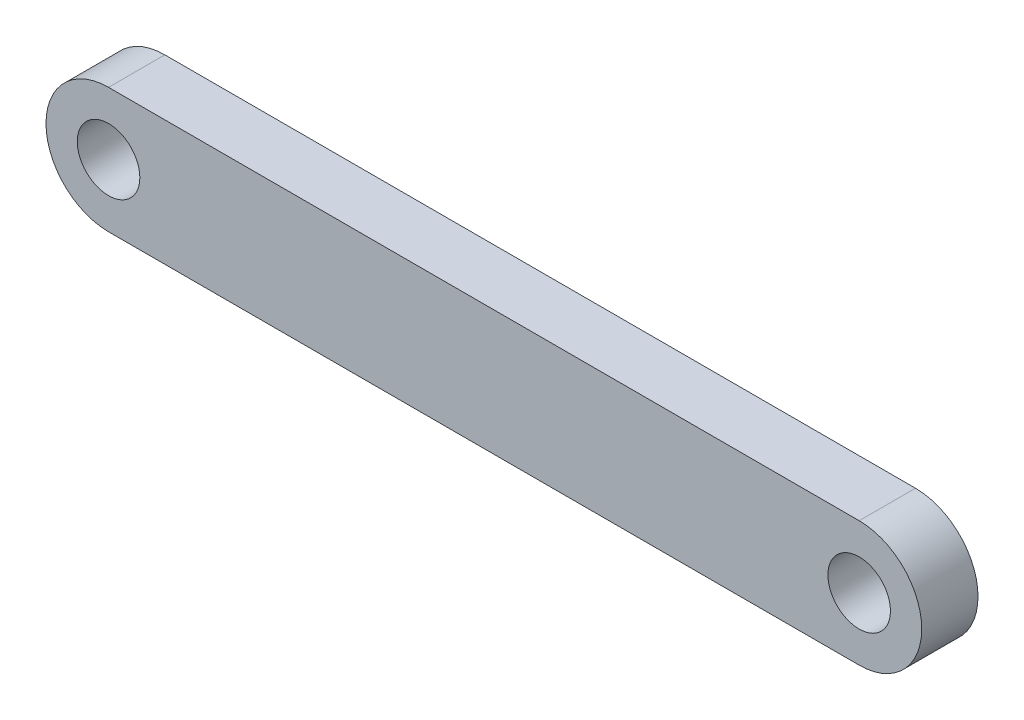
ISO-10303-21;
HEADER;
FILE_DESCRIPTION(('STEP AP214'),'2;1');
FILE_NAME('part.step','',(''),(''),'','','');
FILE_SCHEMA(('AUTOMOTIVE_DESIGN { 1 0 10303 214 1 1 1 1 }'));
ENDSEC;
DATA;
#1=APPLICATION_CONTEXT('core data for automotive mechanical design processes');
#2=APPLICATION_PROTOCOL_DEFINITION('international standard','automotive_design',2000,#1);
#3=PRODUCT_CONTEXT('',#1,'mechanical');
#4=PRODUCT('Part','Part','',(#3));
#5=PRODUCT_RELATED_PRODUCT_CATEGORY('part','',(#4));
#6=PRODUCT_DEFINITION_FORMATION('','',#4);
#7=PRODUCT_DEFINITION_CONTEXT('part definition',#1,'design');
#8=PRODUCT_DEFINITION('design','',#6,#7);
#9=PRODUCT_DEFINITION_SHAPE('','',#8);
#10=(LENGTH_UNIT() NAMED_UNIT(*) SI_UNIT(.MILLI.,.METRE.));
#11=(NAMED_UNIT(*) PLANE_ANGLE_UNIT() SI_UNIT($,.RADIAN.));
#12=(NAMED_UNIT(*) SI_UNIT($,.STERADIAN.) SOLID_ANGLE_UNIT());
#13=UNCERTAINTY_MEASURE_WITH_UNIT(LENGTH_MEASURE(1.E-05),#10,'distance_accuracy_value','');
#14=(GEOMETRIC_REPRESENTATION_CONTEXT(3) GLOBAL_UNCERTAINTY_ASSIGNED_CONTEXT((#13)) GLOBAL_UNIT_ASSIGNED_CONTEXT((#10,
#11,#12)) REPRESENTATION_CONTEXT('',''));
#15=CARTESIAN_POINT('',(0.,0.,0.));
#16=DIRECTION('',(0.,0.,1.));
#17=DIRECTION('',(1.,0.,0.));
#18=AXIS2_PLACEMENT_3D('',#15,#16,#17);
#19=CARTESIAN_POINT('',(-60.,0.,4.5));
#20=DIRECTION('',(0.,0.,1.));
#21=DIRECTION('',(1.,0.,0.));
#22=AXIS2_PLACEMENT_3D('',#19,#20,#21);
#23=PLANE('',#22);
#24=CARTESIAN_POINT('',(-60.,0.,4.5));
#25=DIRECTION('',(0.,0.,1.));
#26=DIRECTION('',(1.,0.,0.));
#27=AXIS2_PLACEMENT_3D('',#24,#25,#26);
#28=CIRCLE('',#27,5.);
#29=CARTESIAN_POINT('',(-55.,0.,4.5));
#30=VERTEX_POINT('',#29);
#31=EDGE_CURVE('E112',#30,#30,#28,.T.);
#32=ORIENTED_EDGE('',*,*,#31,.F.);
#33=EDGE_LOOP('',(#32));
#34=FACE_BOUND('',#33,.T.);
#35=CARTESIAN_POINT('',(-60.,0.,4.5));
#36=DIRECTION('',(0.,0.,1.));
#37=DIRECTION('',(1.,0.,0.));
#38=AXIS2_PLACEMENT_3D('',#35,#36,#37);
#39=CIRCLE('',#38,10.);
#40=CARTESIAN_POINT('',(-60.,10.,4.5));
#41=VERTEX_POINT('',#40);
#42=CARTESIAN_POINT('',(-60.,-10.,4.5));
#43=VERTEX_POINT('',#42);
#44=EDGE_CURVE('E92',#41,#43,#39,.T.);
#45=ORIENTED_EDGE('',*,*,#44,.T.);
#46=DIRECTION('',(1.,0.,0.));
#47=VECTOR('',#46,1.);
#48=CARTESIAN_POINT('',(-60.,-10.,4.5));
#49=LINE('',#48,#47);
#50=CARTESIAN_POINT('',(60.,-9.99999999999998,4.5));
#51=VERTEX_POINT('',#50);
#52=EDGE_CURVE('E87',#43,#51,#49,.T.);
#53=ORIENTED_EDGE('',*,*,#52,.T.);
#54=CARTESIAN_POINT('',(60.,0.,4.5));
#55=DIRECTION('',(0.,0.,1.));
#56=DIRECTION('',(1.,0.,0.));
#57=AXIS2_PLACEMENT_3D('',#54,#55,#56);
#58=CIRCLE('',#57,10.);
#59=CARTESIAN_POINT('',(60.,10.,4.5));
#60=VERTEX_POINT('',#59);
#61=EDGE_CURVE('E90',#51,#60,#58,.T.);
#62=ORIENTED_EDGE('',*,*,#61,.T.);
#63=DIRECTION('',(-1.,0.,0.));
#64=VECTOR('',#63,1.);
#65=CARTESIAN_POINT('',(-60.,10.,4.5));
#66=LINE('',#65,#64);
#67=EDGE_CURVE('E57',#60,#41,#66,.T.);
#68=ORIENTED_EDGE('',*,*,#67,.T.);
#69=EDGE_LOOP('',(#45,#53,#62,#68));
#70=FACE_BOUND('',#69,.T.);
#71=CARTESIAN_POINT('',(60.,0.,4.5));
#72=DIRECTION('',(0.,0.,1.));
#73=DIRECTION('',(1.,0.,0.));
#74=AXIS2_PLACEMENT_3D('',#71,#72,#73);
#75=CIRCLE('',#74,5.);
#76=CARTESIAN_POINT('',(65.,0.,4.5));
#77=VERTEX_POINT('',#76);
#78=EDGE_CURVE('E134',#77,#77,#75,.T.);
#79=ORIENTED_EDGE('',*,*,#78,.F.);
#80=EDGE_LOOP('',(#79));
#81=FACE_BOUND('',#80,.T.);
#82=ADVANCED_FACE('F39',(#34,#70,#81),#23,.T.);
#83=CARTESIAN_POINT('',(-60.,0.,-4.5));
#84=DIRECTION('',(0.,0.,1.));
#85=DIRECTION('',(1.,0.,0.));
#86=AXIS2_PLACEMENT_3D('',#83,#84,#85);
#87=PLANE('',#86);
#88=CARTESIAN_POINT('',(-60.,0.,-4.5));
#89=DIRECTION('',(0.,0.,1.));
#90=DIRECTION('',(1.,0.,0.));
#91=AXIS2_PLACEMENT_3D('',#88,#89,#90);
#92=CIRCLE('',#91,10.);
#93=CARTESIAN_POINT('',(-60.,10.,-4.5));
#94=VERTEX_POINT('',#93);
#95=CARTESIAN_POINT('',(-60.,-10.,-4.5));
#96=VERTEX_POINT('',#95);
#97=EDGE_CURVE('E108',#94,#96,#92,.T.);
#98=ORIENTED_EDGE('',*,*,#97,.F.);
#99=DIRECTION('',(-1.,0.,0.));
#100=VECTOR('',#99,1.);
#101=CARTESIAN_POINT('',(-60.,10.,-4.5));
#102=LINE('',#101,#100);
#103=CARTESIAN_POINT('',(60.,10.,-4.5));
#104=VERTEX_POINT('',#103);
#105=EDGE_CURVE('E80',#104,#94,#102,.T.);
#106=ORIENTED_EDGE('',*,*,#105,.F.);
#107=CARTESIAN_POINT('',(60.,0.,-4.5));
#108=DIRECTION('',(0.,0.,1.));
#109=DIRECTION('',(1.,0.,0.));
#110=AXIS2_PLACEMENT_3D('',#107,#108,#109);
#111=CIRCLE('',#110,10.);
#112=CARTESIAN_POINT('',(60.,-9.99999999999998,-4.5));
#113=VERTEX_POINT('',#112);
#114=EDGE_CURVE('E74',#113,#104,#111,.T.);
#115=ORIENTED_EDGE('',*,*,#114,.F.);
#116=DIRECTION('',(1.,0.,0.));
#117=VECTOR('',#116,1.);
#118=CARTESIAN_POINT('',(-60.,-10.,-4.5));
#119=LINE('',#118,#117);
#120=EDGE_CURVE('E97',#96,#113,#119,.T.);
#121=ORIENTED_EDGE('',*,*,#120,.F.);
#122=EDGE_LOOP('',(#98,#106,#115,#121));
#123=FACE_BOUND('',#122,.T.);
#124=CARTESIAN_POINT('',(-60.,0.,-4.5));
#125=DIRECTION('',(0.,0.,1.));
#126=DIRECTION('',(1.,0.,0.));
#127=AXIS2_PLACEMENT_3D('',#124,#125,#126);
#128=CIRCLE('',#127,5.);
#129=CARTESIAN_POINT('',(-55.,0.,-4.5));
#130=VERTEX_POINT('',#129);
#131=EDGE_CURVE('E130',#130,#130,#128,.T.);
#132=ORIENTED_EDGE('',*,*,#131,.T.);
#133=EDGE_LOOP('',(#132));
#134=FACE_BOUND('',#133,.T.);
#135=CARTESIAN_POINT('',(60.,0.,-4.5));
#136=DIRECTION('',(0.,0.,1.));
#137=DIRECTION('',(1.,0.,0.));
#138=AXIS2_PLACEMENT_3D('',#135,#136,#137);
#139=CIRCLE('',#138,5.);
#140=CARTESIAN_POINT('',(65.,0.,-4.5));
#141=VERTEX_POINT('',#140);
#142=EDGE_CURVE('E138',#141,#141,#139,.T.);
#143=ORIENTED_EDGE('',*,*,#142,.T.);
#144=EDGE_LOOP('',(#143));
#145=FACE_BOUND('',#144,.T.);
#146=ADVANCED_FACE('F125',(#123,#134,#145),#87,.F.);
#147=CARTESIAN_POINT('',(-60.,0.,4.5));
#148=DIRECTION('',(0.,0.,-1.));
#149=DIRECTION('',(-1.,0.,0.));
#150=AXIS2_PLACEMENT_3D('',#147,#148,#149);
#151=CYLINDRICAL_SURFACE('',#150,10.);
#152=ORIENTED_EDGE('',*,*,#97,.T.);
#153=DIRECTION('',(0.,0.,-1.));
#154=VECTOR('',#153,1.);
#155=CARTESIAN_POINT('',(-60.,-10.,4.5));
#156=LINE('',#155,#154);
#157=EDGE_CURVE('E11',#43,#96,#156,.T.);
#158=ORIENTED_EDGE('',*,*,#157,.F.);
#159=ORIENTED_EDGE('',*,*,#44,.F.);
#160=DIRECTION('',(0.,0.,-1.));
#161=VECTOR('',#160,1.);
#162=CARTESIAN_POINT('',(-60.,10.,4.5));
#163=LINE('',#162,#161);
#164=EDGE_CURVE('E104',#41,#94,#163,.T.);
#165=ORIENTED_EDGE('',*,*,#164,.T.);
#166=EDGE_LOOP('',(#152,#158,#159,#165));
#167=FACE_BOUND('',#166,.T.);
#168=ADVANCED_FACE('F41',(#167),#151,.T.);
#169=CARTESIAN_POINT('',(-60.,-10.,4.5));
#170=DIRECTION('',(0.,1.,0.));
#171=DIRECTION('',(-1.,0.,0.));
#172=AXIS2_PLACEMENT_3D('',#169,#170,#171);
#173=PLANE('',#172);
#174=ORIENTED_EDGE('',*,*,#120,.T.);
#175=DIRECTION('',(0.,0.,-1.));
#176=VECTOR('',#175,1.);
#177=CARTESIAN_POINT('',(60.,-9.99999999999998,4.5));
#178=LINE('',#177,#176);
#179=EDGE_CURVE('E49',#51,#113,#178,.T.);
#180=ORIENTED_EDGE('',*,*,#179,.F.);
#181=ORIENTED_EDGE('',*,*,#52,.F.);
#182=ORIENTED_EDGE('',*,*,#157,.T.);
#183=EDGE_LOOP('',(#174,#180,#181,#182));
#184=FACE_BOUND('',#183,.T.);
#185=ADVANCED_FACE('F96',(#184),#173,.F.);
#186=CARTESIAN_POINT('',(60.,0.,4.5));
#187=DIRECTION('',(0.,0.,-1.));
#188=DIRECTION('',(-1.,0.,0.));
#189=AXIS2_PLACEMENT_3D('',#186,#187,#188);
#190=CYLINDRICAL_SURFACE('',#189,10.);
#191=ORIENTED_EDGE('',*,*,#114,.T.);
#192=DIRECTION('',(0.,0.,-1.));
#193=VECTOR('',#192,1.);
#194=CARTESIAN_POINT('',(60.,10.,4.5));
#195=LINE('',#194,#193);
#196=EDGE_CURVE('E99',#60,#104,#195,.T.);
#197=ORIENTED_EDGE('',*,*,#196,.F.);
#198=ORIENTED_EDGE('',*,*,#61,.F.);
#199=ORIENTED_EDGE('',*,*,#179,.T.);
#200=EDGE_LOOP('',(#191,#197,#198,#199));
#201=FACE_BOUND('',#200,.T.);
#202=ADVANCED_FACE('F100',(#201),#190,.T.);
#203=CARTESIAN_POINT('',(-60.,10.,4.5));
#204=DIRECTION('',(0.,-1.,0.));
#205=DIRECTION('',(1.,0.,0.));
#206=AXIS2_PLACEMENT_3D('',#203,#204,#205);
#207=PLANE('',#206);
#208=ORIENTED_EDGE('',*,*,#105,.T.);
#209=ORIENTED_EDGE('',*,*,#164,.F.);
#210=ORIENTED_EDGE('',*,*,#67,.F.);
#211=ORIENTED_EDGE('',*,*,#196,.T.);
#212=EDGE_LOOP('',(#208,#209,#210,#211));
#213=FACE_BOUND('',#212,.T.);
#214=ADVANCED_FACE('F122',(#213),#207,.F.);
#215=CARTESIAN_POINT('',(-60.,0.,4.5));
#216=DIRECTION('',(0.,0.,-1.));
#217=DIRECTION('',(-1.,0.,0.));
#218=AXIS2_PLACEMENT_3D('',#215,#216,#217);
#219=CYLINDRICAL_SURFACE('',#218,5.);
#220=ORIENTED_EDGE('',*,*,#31,.T.);
#221=EDGE_LOOP('',(#220));
#222=FACE_BOUND('',#221,.T.);
#223=ORIENTED_EDGE('',*,*,#131,.F.);
#224=EDGE_LOOP('',(#223));
#225=FACE_BOUND('',#224,.T.);
#226=ADVANCED_FACE('F157',(#222,#225),#219,.F.);
#227=CARTESIAN_POINT('',(60.,0.,4.5));
#228=DIRECTION('',(0.,0.,-1.));
#229=DIRECTION('',(-1.,0.,0.));
#230=AXIS2_PLACEMENT_3D('',#227,#228,#229);
#231=CYLINDRICAL_SURFACE('',#230,5.);
#232=ORIENTED_EDGE('',*,*,#78,.T.);
#233=EDGE_LOOP('',(#232));
#234=FACE_BOUND('',#233,.T.);
#235=ORIENTED_EDGE('',*,*,#142,.F.);
#236=EDGE_LOOP('',(#235));
#237=FACE_BOUND('',#236,.T.);
#238=ADVANCED_FACE('F146',(#234,#237),#231,.F.);
#239=CLOSED_SHELL('',(#82,#146,#168,#185,#202,#214,#226,#238));
#240=MANIFOLD_SOLID_BREP('B2',#239);
#241=ADVANCED_BREP_SHAPE_REPRESENTATION('',(#18,#240),#14);
#242=SHAPE_DEFINITION_REPRESENTATION(#9,#241);
ENDSEC;
END-ISO-10303-21;
